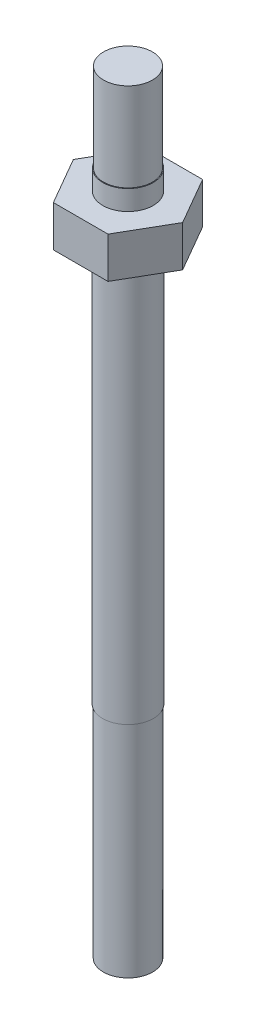
ISO-10303-21;
HEADER;
FILE_DESCRIPTION(('STEP AP214'),'2;1');
FILE_NAME('part.step','',(''),(''),'','','');
FILE_SCHEMA(('AUTOMOTIVE_DESIGN { 1 0 10303 214 1 1 1 1 }'));
ENDSEC;
DATA;
#1=APPLICATION_CONTEXT('core data for automotive mechanical design processes');
#2=APPLICATION_PROTOCOL_DEFINITION('international standard','automotive_design',2000,#1);
#3=PRODUCT_CONTEXT('',#1,'mechanical');
#4=PRODUCT('Part','Part','',(#3));
#5=PRODUCT_RELATED_PRODUCT_CATEGORY('part','',(#4));
#6=PRODUCT_DEFINITION_FORMATION('','',#4);
#7=PRODUCT_DEFINITION_CONTEXT('part definition',#1,'design');
#8=PRODUCT_DEFINITION('design','',#6,#7);
#9=PRODUCT_DEFINITION_SHAPE('','',#8);
#10=(LENGTH_UNIT() NAMED_UNIT(*) SI_UNIT(.MILLI.,.METRE.));
#11=(NAMED_UNIT(*) PLANE_ANGLE_UNIT() SI_UNIT($,.RADIAN.));
#12=(NAMED_UNIT(*) SI_UNIT($,.STERADIAN.) SOLID_ANGLE_UNIT());
#13=UNCERTAINTY_MEASURE_WITH_UNIT(LENGTH_MEASURE(1.E-05),#10,'distance_accuracy_value','');
#14=(GEOMETRIC_REPRESENTATION_CONTEXT(3) GLOBAL_UNCERTAINTY_ASSIGNED_CONTEXT((#13)) GLOBAL_UNIT_ASSIGNED_CONTEXT((#10,
#11,#12)) REPRESENTATION_CONTEXT('',''));
#15=CARTESIAN_POINT('',(0.,0.,0.));
#16=DIRECTION('',(0.,0.,1.));
#17=DIRECTION('',(1.,0.,0.));
#18=AXIS2_PLACEMENT_3D('',#15,#16,#17);
#19=CARTESIAN_POINT('',(0.,-42.0878,0.));
#20=DIRECTION('',(0.,1.,0.));
#21=DIRECTION('',(0.,0.,1.));
#22=AXIS2_PLACEMENT_3D('',#19,#20,#21);
#23=CYLINDRICAL_SURFACE('',#22,1.7145);
#24=CARTESIAN_POINT('',(0.,0.,0.));
#25=DIRECTION('',(0.,1.,0.));
#26=DIRECTION('',(0.,0.,1.));
#27=AXIS2_PLACEMENT_3D('',#24,#25,#26);
#28=CIRCLE('',#27,1.7145);
#29=CARTESIAN_POINT('',(0.,0.,1.7145));
#30=VERTEX_POINT('',#29);
#31=EDGE_CURVE('E11',#30,#30,#28,.T.);
#32=ORIENTED_EDGE('',*,*,#31,.F.);
#33=EDGE_LOOP('',(#32));
#34=FACE_BOUND('',#33,.T.);
#35=CARTESIAN_POINT('',(0.,-27.2288,0.));
#36=DIRECTION('',(0.,-1.,0.));
#37=DIRECTION('',(0.,0.,-1.));
#38=AXIS2_PLACEMENT_3D('',#35,#36,#37);
#39=CIRCLE('',#38,1.7145);
#40=CARTESIAN_POINT('',(0.,-27.2288,-1.7145));
#41=VERTEX_POINT('',#40);
#42=EDGE_CURVE('E160',#41,#41,#39,.T.);
#43=ORIENTED_EDGE('',*,*,#42,.F.);
#44=EDGE_LOOP('',(#43));
#45=FACE_BOUND('',#44,.T.);
#46=ADVANCED_FACE('F34',(#34,#45),#23,.T.);
#47=CARTESIAN_POINT('',(0.,10.0838,0.));
#48=DIRECTION('',(0.,-1.,0.));
#49=DIRECTION('',(0.,0.,-1.));
#50=AXIS2_PLACEMENT_3D('',#47,#48,#49);
#51=CYLINDRICAL_SURFACE('',#50,1.7018);
#52=CARTESIAN_POINT('',(0.,2.7686,0.));
#53=DIRECTION('',(0.,1.,0.));
#54=DIRECTION('',(0.,0.,1.));
#55=AXIS2_PLACEMENT_3D('',#52,#53,#54);
#56=CIRCLE('',#55,1.7018);
#57=CARTESIAN_POINT('',(0.,2.7686,1.7018));
#58=VERTEX_POINT('',#57);
#59=EDGE_CURVE('E124',#58,#58,#56,.T.);
#60=ORIENTED_EDGE('',*,*,#59,.T.);
#61=EDGE_LOOP('',(#60));
#62=FACE_BOUND('',#61,.T.);
#63=CARTESIAN_POINT('',(0.,4.1148,0.));
#64=DIRECTION('',(0.,1.,0.));
#65=DIRECTION('',(0.,0.,1.));
#66=AXIS2_PLACEMENT_3D('',#63,#64,#65);
#67=CIRCLE('',#66,1.7018);
#68=CARTESIAN_POINT('',(0.,4.1148,1.7018));
#69=VERTEX_POINT('',#68);
#70=EDGE_CURVE('E153',#69,#69,#67,.T.);
#71=ORIENTED_EDGE('',*,*,#70,.F.);
#72=EDGE_LOOP('',(#71));
#73=FACE_BOUND('',#72,.T.);
#74=ADVANCED_FACE('F183',(#62,#73),#51,.T.);
#75=CARTESIAN_POINT('',(0.,2.7686,0.));
#76=DIRECTION('',(0.,1.,0.));
#77=DIRECTION('',(0.,0.,1.));
#78=AXIS2_PLACEMENT_3D('',#75,#76,#77);
#79=PLANE('',#78);
#80=DIRECTION('',(-0.5,0.,-0.866025403784439));
#81=VECTOR('',#80,1.);
#82=CARTESIAN_POINT('',(3.68958774747578,2.7686,0.));
#83=LINE('',#82,#81);
#84=CARTESIAN_POINT('',(3.68958774747578,2.7686,0.));
#85=VERTEX_POINT('',#84);
#86=CARTESIAN_POINT('',(1.84479387373789,2.7686,-3.19527671880583));
#87=VERTEX_POINT('',#86);
#88=EDGE_CURVE('E131',#85,#87,#83,.T.);
#89=ORIENTED_EDGE('',*,*,#88,.T.);
#90=DIRECTION('',(-1.,0.,0.));
#91=VECTOR('',#90,1.);
#92=CARTESIAN_POINT('',(1.84479387373789,2.7686,-3.19527671880583));
#93=LINE('',#92,#91);
#94=CARTESIAN_POINT('',(-1.84479387373789,2.7686,-3.19527671880583));
#95=VERTEX_POINT('',#94);
#96=EDGE_CURVE('E88',#87,#95,#93,.T.);
#97=ORIENTED_EDGE('',*,*,#96,.T.);
#98=DIRECTION('',(-0.5,0.,0.866025403784439));
#99=VECTOR('',#98,1.);
#100=CARTESIAN_POINT('',(-1.84479387373789,2.7686,-3.19527671880583));
#101=LINE('',#100,#99);
#102=CARTESIAN_POINT('',(-3.68958774747578,2.7686,0.));
#103=VERTEX_POINT('',#102);
#104=EDGE_CURVE('E102',#95,#103,#101,.T.);
#105=ORIENTED_EDGE('',*,*,#104,.T.);
#106=DIRECTION('',(0.5,0.,0.866025403784438));
#107=VECTOR('',#106,1.);
#108=CARTESIAN_POINT('',(-3.68958774747578,2.7686,0.));
#109=LINE('',#108,#107);
#110=CARTESIAN_POINT('',(-1.84479387373789,2.7686,3.19527671880583));
#111=VERTEX_POINT('',#110);
#112=EDGE_CURVE('E95',#103,#111,#109,.T.);
#113=ORIENTED_EDGE('',*,*,#112,.T.);
#114=DIRECTION('',(1.,0.,0.));
#115=VECTOR('',#114,1.);
#116=CARTESIAN_POINT('',(-1.84479387373789,2.7686,3.19527671880583));
#117=LINE('',#116,#115);
#118=CARTESIAN_POINT('',(1.84479387373789,2.7686,3.19527671880583));
#119=VERTEX_POINT('',#118);
#120=EDGE_CURVE('E100',#111,#119,#117,.T.);
#121=ORIENTED_EDGE('',*,*,#120,.T.);
#122=DIRECTION('',(0.5,0.,-0.866025403784438));
#123=VECTOR('',#122,1.);
#124=CARTESIAN_POINT('',(1.84479387373789,2.7686,3.19527671880583));
#125=LINE('',#124,#123);
#126=EDGE_CURVE('E50',#119,#85,#125,.T.);
#127=ORIENTED_EDGE('',*,*,#126,.T.);
#128=EDGE_LOOP('',(#89,#97,#105,#113,#121,#127));
#129=FACE_BOUND('',#128,.T.);
#130=ORIENTED_EDGE('',*,*,#59,.F.);
#131=EDGE_LOOP('',(#130));
#132=FACE_BOUND('',#131,.T.);
#133=ADVANCED_FACE('F97',(#129,#132),#79,.T.);
#134=CARTESIAN_POINT('',(3.68958774747578,2.7686,0.));
#135=DIRECTION('',(-0.866025403784439,0.,0.5));
#136=DIRECTION('',(0.5,0.,0.866025403784439));
#137=AXIS2_PLACEMENT_3D('',#134,#135,#136);
#138=PLANE('',#137);
#139=DIRECTION('',(-0.5,0.,-0.866025403784439));
#140=VECTOR('',#139,1.);
#141=CARTESIAN_POINT('',(3.68958774747578,0.,0.));
#142=LINE('',#141,#140);
#143=CARTESIAN_POINT('',(3.68958774747578,0.,0.));
#144=VERTEX_POINT('',#143);
#145=CARTESIAN_POINT('',(1.84479387373789,0.,-3.19527671880583));
#146=VERTEX_POINT('',#145);
#147=EDGE_CURVE('E120',#144,#146,#142,.T.);
#148=ORIENTED_EDGE('',*,*,#147,.T.);
#149=DIRECTION('',(0.,-1.,0.));
#150=VECTOR('',#149,1.);
#151=CARTESIAN_POINT('',(1.84479387373789,2.7686,-3.19527671880583));
#152=LINE('',#151,#150);
#153=EDGE_CURVE('E42',#87,#146,#152,.T.);
#154=ORIENTED_EDGE('',*,*,#153,.F.);
#155=ORIENTED_EDGE('',*,*,#88,.F.);
#156=DIRECTION('',(0.,-1.,0.));
#157=VECTOR('',#156,1.);
#158=CARTESIAN_POINT('',(3.68958774747578,2.7686,0.));
#159=LINE('',#158,#157);
#160=EDGE_CURVE('E116',#85,#144,#159,.T.);
#161=ORIENTED_EDGE('',*,*,#160,.T.);
#162=EDGE_LOOP('',(#148,#154,#155,#161));
#163=FACE_BOUND('',#162,.T.);
#164=ADVANCED_FACE('F142',(#163),#138,.F.);
#165=CARTESIAN_POINT('',(1.84479387373789,2.7686,-3.19527671880583));
#166=DIRECTION('',(0.,0.,1.));
#167=DIRECTION('',(1.,0.,0.));
#168=AXIS2_PLACEMENT_3D('',#165,#166,#167);
#169=PLANE('',#168);
#170=DIRECTION('',(-1.,0.,0.));
#171=VECTOR('',#170,1.);
#172=CARTESIAN_POINT('',(1.84479387373789,0.,-3.19527671880583));
#173=LINE('',#172,#171);
#174=CARTESIAN_POINT('',(-1.84479387373789,0.,-3.19527671880583));
#175=VERTEX_POINT('',#174);
#176=EDGE_CURVE('E123',#146,#175,#173,.T.);
#177=ORIENTED_EDGE('',*,*,#176,.T.);
#178=DIRECTION('',(0.,-1.,0.));
#179=VECTOR('',#178,1.);
#180=CARTESIAN_POINT('',(-1.84479387373789,2.7686,-3.19527671880583));
#181=LINE('',#180,#179);
#182=EDGE_CURVE('E135',#95,#175,#181,.T.);
#183=ORIENTED_EDGE('',*,*,#182,.F.);
#184=ORIENTED_EDGE('',*,*,#96,.F.);
#185=ORIENTED_EDGE('',*,*,#153,.T.);
#186=EDGE_LOOP('',(#177,#183,#184,#185));
#187=FACE_BOUND('',#186,.T.);
#188=ADVANCED_FACE('F138',(#187),#169,.F.);
#189=CARTESIAN_POINT('',(-1.84479387373789,2.7686,-3.19527671880583));
#190=DIRECTION('',(0.866025403784439,0.,0.5));
#191=DIRECTION('',(0.5,0.,-0.866025403784439));
#192=AXIS2_PLACEMENT_3D('',#189,#190,#191);
#193=PLANE('',#192);
#194=DIRECTION('',(-0.5,0.,0.866025403784439));
#195=VECTOR('',#194,1.);
#196=CARTESIAN_POINT('',(-1.84479387373789,0.,-3.19527671880583));
#197=LINE('',#196,#195);
#198=CARTESIAN_POINT('',(-3.68958774747578,0.,0.));
#199=VERTEX_POINT('',#198);
#200=EDGE_CURVE('E126',#175,#199,#197,.T.);
#201=ORIENTED_EDGE('',*,*,#200,.T.);
#202=DIRECTION('',(0.,-1.,0.));
#203=VECTOR('',#202,1.);
#204=CARTESIAN_POINT('',(-3.68958774747578,2.7686,0.));
#205=LINE('',#204,#203);
#206=EDGE_CURVE('E111',#103,#199,#205,.T.);
#207=ORIENTED_EDGE('',*,*,#206,.F.);
#208=ORIENTED_EDGE('',*,*,#104,.F.);
#209=ORIENTED_EDGE('',*,*,#182,.T.);
#210=EDGE_LOOP('',(#201,#207,#208,#209));
#211=FACE_BOUND('',#210,.T.);
#212=ADVANCED_FACE('F147',(#211),#193,.F.);
#213=CARTESIAN_POINT('',(-3.68958774747578,2.7686,0.));
#214=DIRECTION('',(0.866025403784439,0.,-0.5));
#215=DIRECTION('',(-0.5,0.,-0.866025403784439));
#216=AXIS2_PLACEMENT_3D('',#213,#214,#215);
#217=PLANE('',#216);
#218=DIRECTION('',(0.5,0.,0.866025403784438));
#219=VECTOR('',#218,1.);
#220=CARTESIAN_POINT('',(-3.68958774747578,0.,0.));
#221=LINE('',#220,#219);
#222=CARTESIAN_POINT('',(-1.84479387373789,0.,3.19527671880583));
#223=VERTEX_POINT('',#222);
#224=EDGE_CURVE('E110',#199,#223,#221,.T.);
#225=ORIENTED_EDGE('',*,*,#224,.T.);
#226=DIRECTION('',(0.,-1.,0.));
#227=VECTOR('',#226,1.);
#228=CARTESIAN_POINT('',(-1.84479387373789,2.7686,3.19527671880583));
#229=LINE('',#228,#227);
#230=EDGE_CURVE('E107',#111,#223,#229,.T.);
#231=ORIENTED_EDGE('',*,*,#230,.F.);
#232=ORIENTED_EDGE('',*,*,#112,.F.);
#233=ORIENTED_EDGE('',*,*,#206,.T.);
#234=EDGE_LOOP('',(#225,#231,#232,#233));
#235=FACE_BOUND('',#234,.T.);
#236=ADVANCED_FACE('F108',(#235),#217,.F.);
#237=CARTESIAN_POINT('',(-1.84479387373789,2.7686,3.19527671880583));
#238=DIRECTION('',(0.,0.,-1.));
#239=DIRECTION('',(-1.,0.,0.));
#240=AXIS2_PLACEMENT_3D('',#237,#238,#239);
#241=PLANE('',#240);
#242=DIRECTION('',(1.,0.,0.));
#243=VECTOR('',#242,1.);
#244=CARTESIAN_POINT('',(-1.84479387373789,0.,3.19527671880583));
#245=LINE('',#244,#243);
#246=CARTESIAN_POINT('',(1.84479387373789,0.,3.19527671880583));
#247=VERTEX_POINT('',#246);
#248=EDGE_CURVE('E73',#223,#247,#245,.T.);
#249=ORIENTED_EDGE('',*,*,#248,.T.);
#250=DIRECTION('',(0.,-1.,0.));
#251=VECTOR('',#250,1.);
#252=CARTESIAN_POINT('',(1.84479387373789,2.7686,3.19527671880583));
#253=LINE('',#252,#251);
#254=EDGE_CURVE('E112',#119,#247,#253,.T.);
#255=ORIENTED_EDGE('',*,*,#254,.F.);
#256=ORIENTED_EDGE('',*,*,#120,.F.);
#257=ORIENTED_EDGE('',*,*,#230,.T.);
#258=EDGE_LOOP('',(#249,#255,#256,#257));
#259=FACE_BOUND('',#258,.T.);
#260=ADVANCED_FACE('F114',(#259),#241,.F.);
#261=CARTESIAN_POINT('',(1.84479387373789,2.7686,3.19527671880583));
#262=DIRECTION('',(-0.866025403784439,0.,-0.5));
#263=DIRECTION('',(-0.5,0.,0.866025403784439));
#264=AXIS2_PLACEMENT_3D('',#261,#262,#263);
#265=PLANE('',#264);
#266=DIRECTION('',(0.5,0.,-0.866025403784438));
#267=VECTOR('',#266,1.);
#268=CARTESIAN_POINT('',(1.84479387373789,0.,3.19527671880583));
#269=LINE('',#268,#267);
#270=EDGE_CURVE('E79',#247,#144,#269,.T.);
#271=ORIENTED_EDGE('',*,*,#270,.T.);
#272=ORIENTED_EDGE('',*,*,#160,.F.);
#273=ORIENTED_EDGE('',*,*,#126,.F.);
#274=ORIENTED_EDGE('',*,*,#254,.T.);
#275=EDGE_LOOP('',(#271,#272,#273,#274));
#276=FACE_BOUND('',#275,.T.);
#277=ADVANCED_FACE('F194',(#276),#265,.F.);
#278=CARTESIAN_POINT('',(0.,0.,0.));
#279=DIRECTION('',(0.,1.,0.));
#280=DIRECTION('',(0.,0.,1.));
#281=AXIS2_PLACEMENT_3D('',#278,#279,#280);
#282=PLANE('',#281);
#283=ORIENTED_EDGE('',*,*,#31,.T.);
#284=EDGE_LOOP('',(#283));
#285=FACE_BOUND('',#284,.T.);
#286=ORIENTED_EDGE('',*,*,#147,.F.);
#287=ORIENTED_EDGE('',*,*,#270,.F.);
#288=ORIENTED_EDGE('',*,*,#248,.F.);
#289=ORIENTED_EDGE('',*,*,#224,.F.);
#290=ORIENTED_EDGE('',*,*,#200,.F.);
#291=ORIENTED_EDGE('',*,*,#176,.F.);
#292=EDGE_LOOP('',(#286,#287,#288,#289,#290,#291));
#293=FACE_BOUND('',#292,.T.);
#294=ADVANCED_FACE('F144',(#285,#293),#282,.F.);
#295=CARTESIAN_POINT('',(0.,4.1148,0.));
#296=DIRECTION('',(0.,1.,0.));
#297=DIRECTION('',(0.,0.,1.));
#298=AXIS2_PLACEMENT_3D('',#295,#296,#297);
#299=PLANE('',#298);
#300=CARTESIAN_POINT('',(0.,4.1148,0.));
#301=DIRECTION('',(0.,1.,0.));
#302=DIRECTION('',(0.,0.,1.));
#303=AXIS2_PLACEMENT_3D('',#300,#301,#302);
#304=CIRCLE('',#303,1.651);
#305=CARTESIAN_POINT('',(0.,4.1148,1.651));
#306=VERTEX_POINT('',#305);
#307=EDGE_CURVE('E156',#306,#306,#304,.T.);
#308=ORIENTED_EDGE('',*,*,#307,.F.);
#309=EDGE_LOOP('',(#308));
#310=FACE_BOUND('',#309,.T.);
#311=ORIENTED_EDGE('',*,*,#70,.T.);
#312=EDGE_LOOP('',(#311));
#313=FACE_BOUND('',#312,.T.);
#314=ADVANCED_FACE('F193',(#310,#313),#299,.T.);
#315=CARTESIAN_POINT('',(0.,4.1148,0.));
#316=DIRECTION('',(0.,1.,0.));
#317=DIRECTION('',(0.,0.,1.));
#318=AXIS2_PLACEMENT_3D('',#315,#316,#317);
#319=CYLINDRICAL_SURFACE('',#318,1.651);
#320=ORIENTED_EDGE('',*,*,#307,.T.);
#321=EDGE_LOOP('',(#320));
#322=FACE_BOUND('',#321,.T.);
#323=CARTESIAN_POINT('',(0.,10.0838,0.));
#324=DIRECTION('',(0.,1.,0.));
#325=DIRECTION('',(0.,0.,1.));
#326=AXIS2_PLACEMENT_3D('',#323,#324,#325);
#327=CIRCLE('',#326,1.651);
#328=CARTESIAN_POINT('',(0.,10.0838,1.651));
#329=VERTEX_POINT('',#328);
#330=EDGE_CURVE('E157',#329,#329,#327,.T.);
#331=ORIENTED_EDGE('',*,*,#330,.F.);
#332=EDGE_LOOP('',(#331));
#333=FACE_BOUND('',#332,.T.);
#334=ADVANCED_FACE('F200',(#322,#333),#319,.T.);
#335=CARTESIAN_POINT('',(0.,10.0838,0.));
#336=DIRECTION('',(0.,1.,0.));
#337=DIRECTION('',(0.,0.,1.));
#338=AXIS2_PLACEMENT_3D('',#335,#336,#337);
#339=PLANE('',#338);
#340=ORIENTED_EDGE('',*,*,#330,.T.);
#341=EDGE_LOOP('',(#340));
#342=FACE_BOUND('',#341,.T.);
#343=ADVANCED_FACE('F178',(#342),#339,.T.);
#344=CARTESIAN_POINT('',(0.,-27.2288,0.));
#345=DIRECTION('',(0.,-1.,0.));
#346=DIRECTION('',(0.,0.,-1.));
#347=AXIS2_PLACEMENT_3D('',#344,#345,#346);
#348=PLANE('',#347);
#349=CARTESIAN_POINT('',(0.,-27.2288,0.));
#350=DIRECTION('',(0.,-1.,0.));
#351=DIRECTION('',(0.,0.,-1.));
#352=AXIS2_PLACEMENT_3D('',#349,#350,#351);
#353=CIRCLE('',#352,1.6637);
#354=CARTESIAN_POINT('',(0.,-27.2288,-1.6637));
#355=VERTEX_POINT('',#354);
#356=EDGE_CURVE('E165',#355,#355,#353,.T.);
#357=ORIENTED_EDGE('',*,*,#356,.F.);
#358=EDGE_LOOP('',(#357));
#359=FACE_BOUND('',#358,.T.);
#360=ORIENTED_EDGE('',*,*,#42,.T.);
#361=EDGE_LOOP('',(#360));
#362=FACE_BOUND('',#361,.T.);
#363=ADVANCED_FACE('F175',(#359,#362),#348,.T.);
#364=CARTESIAN_POINT('',(0.,-27.2288,0.));
#365=DIRECTION('',(0.,-1.,0.));
#366=DIRECTION('',(0.,0.,-1.));
#367=AXIS2_PLACEMENT_3D('',#364,#365,#366);
#368=CYLINDRICAL_SURFACE('',#367,1.6637);
#369=ORIENTED_EDGE('',*,*,#356,.T.);
#370=EDGE_LOOP('',(#369));
#371=FACE_BOUND('',#370,.T.);
#372=CARTESIAN_POINT('',(0.,-42.0878,0.));
#373=DIRECTION('',(0.,-1.,0.));
#374=DIRECTION('',(0.,0.,-1.));
#375=AXIS2_PLACEMENT_3D('',#372,#373,#374);
#376=CIRCLE('',#375,1.6637);
#377=CARTESIAN_POINT('',(0.,-42.0878,-1.6637));
#378=VERTEX_POINT('',#377);
#379=EDGE_CURVE('E166',#378,#378,#376,.T.);
#380=ORIENTED_EDGE('',*,*,#379,.F.);
#381=EDGE_LOOP('',(#380));
#382=FACE_BOUND('',#381,.T.);
#383=ADVANCED_FACE('F172',(#371,#382),#368,.T.);
#384=CARTESIAN_POINT('',(0.,-42.0878,0.));
#385=DIRECTION('',(0.,1.,0.));
#386=DIRECTION('',(0.,0.,1.));
#387=AXIS2_PLACEMENT_3D('',#384,#385,#386);
#388=PLANE('',#387);
#389=ORIENTED_EDGE('',*,*,#379,.T.);
#390=EDGE_LOOP('',(#389));
#391=FACE_BOUND('',#390,.T.);
#392=ADVANCED_FACE('F215',(#391),#388,.F.);
#393=CLOSED_SHELL('',(#46,#74,#133,#164,#188,#212,#236,#260,#277,#294,#314,#334,#343,#363,#383,#392));
#394=MANIFOLD_SOLID_BREP('B2',#393);
#395=ADVANCED_BREP_SHAPE_REPRESENTATION('',(#18,#394),#14);
#396=SHAPE_DEFINITION_REPRESENTATION(#9,#395);
ENDSEC;
END-ISO-10303-21;
